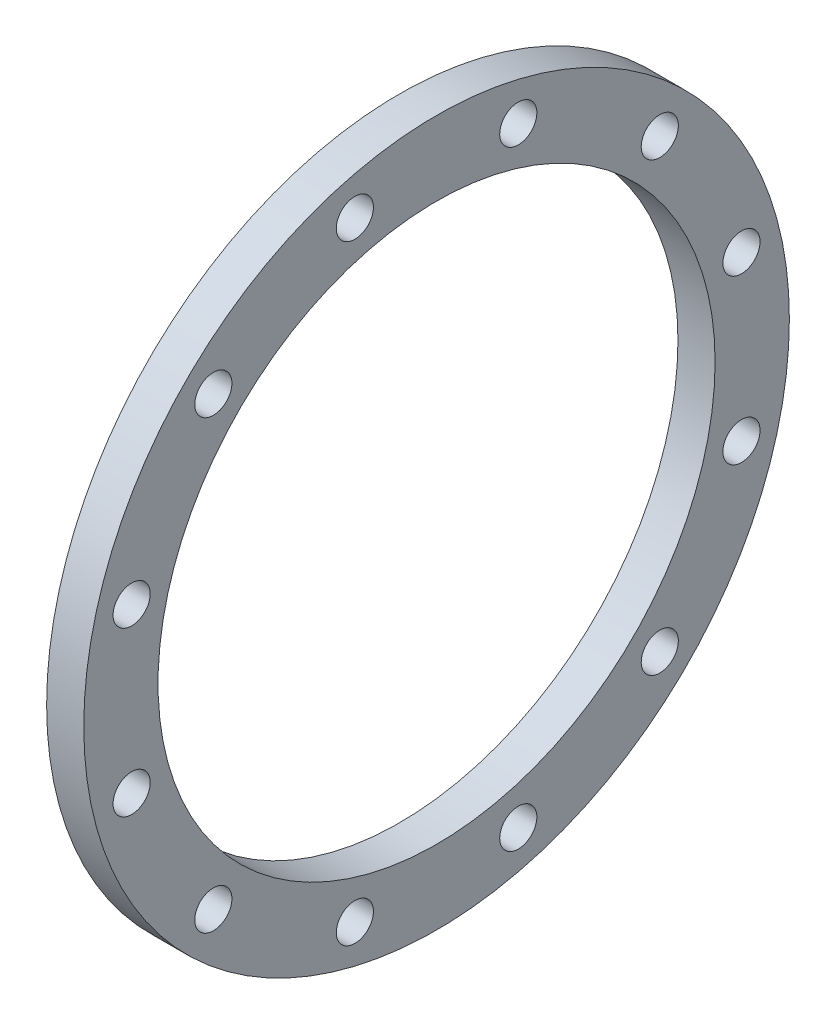
ISO-10303-21;
HEADER;
FILE_DESCRIPTION(('STEP AP214'),'2;1');
FILE_NAME('part.step','',(''),(''),'','','');
FILE_SCHEMA(('AUTOMOTIVE_DESIGN { 1 0 10303 214 1 1 1 1 }'));
ENDSEC;
DATA;
#1=APPLICATION_CONTEXT('core data for automotive mechanical design processes');
#2=APPLICATION_PROTOCOL_DEFINITION('international standard','automotive_design',2000,#1);
#3=PRODUCT_CONTEXT('',#1,'mechanical');
#4=PRODUCT('Part','Part','',(#3));
#5=PRODUCT_RELATED_PRODUCT_CATEGORY('part','',(#4));
#6=PRODUCT_DEFINITION_FORMATION('','',#4);
#7=PRODUCT_DEFINITION_CONTEXT('part definition',#1,'design');
#8=PRODUCT_DEFINITION('design','',#6,#7);
#9=PRODUCT_DEFINITION_SHAPE('','',#8);
#10=(LENGTH_UNIT() NAMED_UNIT(*) SI_UNIT(.MILLI.,.METRE.));
#11=(NAMED_UNIT(*) PLANE_ANGLE_UNIT() SI_UNIT($,.RADIAN.));
#12=(NAMED_UNIT(*) SI_UNIT($,.STERADIAN.) SOLID_ANGLE_UNIT());
#13=UNCERTAINTY_MEASURE_WITH_UNIT(LENGTH_MEASURE(1.E-05),#10,'distance_accuracy_value','');
#14=(GEOMETRIC_REPRESENTATION_CONTEXT(3) GLOBAL_UNCERTAINTY_ASSIGNED_CONTEXT((#13)) GLOBAL_UNIT_ASSIGNED_CONTEXT((#10,
#11,#12)) REPRESENTATION_CONTEXT('',''));
#15=CARTESIAN_POINT('',(0.,0.,0.));
#16=DIRECTION('',(0.,0.,1.));
#17=DIRECTION('',(1.,0.,0.));
#18=AXIS2_PLACEMENT_3D('',#15,#16,#17);
#19=CARTESIAN_POINT('',(12.7,316.3,0.));
#20=DIRECTION('',(1.,0.,0.));
#21=DIRECTION('',(0.,0.,-1.));
#22=AXIS2_PLACEMENT_3D('',#19,#20,#21);
#23=PLANE('',#22);
#24=CARTESIAN_POINT('',(12.7,372.179031837631,-208.543385895811));
#25=DIRECTION('',(1.,0.,0.));
#26=DIRECTION('',(0.,0.499999999999989,-0.866025403784445));
#27=AXIS2_PLACEMENT_3D('',#24,#25,#26);
#28=CIRCLE('',#27,12.7);
#29=CARTESIAN_POINT('',(12.7,378.529031837631,-219.541908523873));
#30=VERTEX_POINT('',#29);
#31=EDGE_CURVE('E74',#30,#30,#28,.T.);
#32=ORIENTED_EDGE('',*,*,#31,.F.);
#33=EDGE_LOOP('',(#32));
#34=FACE_BOUND('',#33,.T.);
#35=CARTESIAN_POINT('',(12.7,468.964354058174,-152.664354058178));
#36=DIRECTION('',(1.,0.,0.));
#37=DIRECTION('',(0.,0.866025403784433,-0.50000000000001));
#38=AXIS2_PLACEMENT_3D('',#35,#36,#37);
#39=CIRCLE('',#38,12.7);
#40=CARTESIAN_POINT('',(12.7,479.962876686236,-159.014354058178));
#41=VERTEX_POINT('',#40);
#42=EDGE_CURVE('E81',#41,#41,#39,.T.);
#43=ORIENTED_EDGE('',*,*,#42,.F.);
#44=EDGE_LOOP('',(#43));
#45=FACE_BOUND('',#44,.T.);
#46=CARTESIAN_POINT('',(12.7,524.843385895809,-55.8790318376366));
#47=DIRECTION('',(1.,0.,0.));
#48=DIRECTION('',(0.,1.,0.));
#49=AXIS2_PLACEMENT_3D('',#46,#47,#48);
#50=CIRCLE('',#49,12.7);
#51=CARTESIAN_POINT('',(12.7,537.543385895809,-55.8790318376367));
#52=VERTEX_POINT('',#51);
#53=EDGE_CURVE('E87',#52,#52,#50,.T.);
#54=ORIENTED_EDGE('',*,*,#53,.F.);
#55=EDGE_LOOP('',(#54));
#56=FACE_BOUND('',#55,.T.);
#57=CARTESIAN_POINT('',(12.7,524.84338589581,55.8790318376321));
#58=DIRECTION('',(1.,0.,0.));
#59=DIRECTION('',(0.,0.866025403784443,0.499999999999992));
#60=AXIS2_PLACEMENT_3D('',#57,#58,#59);
#61=CIRCLE('',#60,12.7);
#62=CARTESIAN_POINT('',(12.7,535.841908523873,62.229031837632));
#63=VERTEX_POINT('',#62);
#64=EDGE_CURVE('E93',#63,#63,#61,.T.);
#65=ORIENTED_EDGE('',*,*,#64,.F.);
#66=EDGE_LOOP('',(#65));
#67=FACE_BOUND('',#66,.T.);
#68=CARTESIAN_POINT('',(12.7,468.964354058177,152.664354058174));
#69=DIRECTION('',(1.,0.,0.));
#70=DIRECTION('',(0.,0.500000000000007,0.866025403784435));
#71=AXIS2_PLACEMENT_3D('',#68,#69,#70);
#72=CIRCLE('',#71,12.7);
#73=CARTESIAN_POINT('',(12.7,475.314354058177,163.662876686237));
#74=VERTEX_POINT('',#73);
#75=EDGE_CURVE('E99',#74,#74,#72,.T.);
#76=ORIENTED_EDGE('',*,*,#75,.F.);
#77=EDGE_LOOP('',(#76));
#78=FACE_BOUND('',#77,.T.);
#79=CARTESIAN_POINT('',(12.7,372.179031837634,208.54338589581));
#80=DIRECTION('',(1.,0.,0.));
#81=DIRECTION('',(0.,0.,1.));
#82=AXIS2_PLACEMENT_3D('',#79,#80,#81);
#83=CIRCLE('',#82,12.7);
#84=CARTESIAN_POINT('',(12.7,372.179031837634,221.24338589581));
#85=VERTEX_POINT('',#84);
#86=EDGE_CURVE('E105',#85,#85,#83,.T.);
#87=ORIENTED_EDGE('',*,*,#86,.F.);
#88=EDGE_LOOP('',(#87));
#89=FACE_BOUND('',#88,.T.);
#90=CARTESIAN_POINT('',(12.7,260.420968162367,208.54338589581));
#91=DIRECTION('',(1.,0.,0.));
#92=DIRECTION('',(0.,-0.499999999999995,0.866025403784442));
#93=AXIS2_PLACEMENT_3D('',#90,#91,#92);
#94=CIRCLE('',#93,12.7);
#95=CARTESIAN_POINT('',(12.7,254.070968162367,219.541908523873));
#96=VERTEX_POINT('',#95);
#97=EDGE_CURVE('E111',#96,#96,#94,.T.);
#98=ORIENTED_EDGE('',*,*,#97,.F.);
#99=EDGE_LOOP('',(#98));
#100=FACE_BOUND('',#99,.T.);
#101=CARTESIAN_POINT('',(12.7,163.635645941825,152.664354058176));
#102=DIRECTION('',(1.,0.,0.));
#103=DIRECTION('',(0.,-0.866025403784436,0.500000000000004));
#104=AXIS2_PLACEMENT_3D('',#101,#102,#103);
#105=CIRCLE('',#104,12.7);
#106=CARTESIAN_POINT('',(12.7,152.637123313763,159.014354058177));
#107=VERTEX_POINT('',#106);
#108=EDGE_CURVE('E117',#107,#107,#105,.T.);
#109=ORIENTED_EDGE('',*,*,#108,.F.);
#110=EDGE_LOOP('',(#109));
#111=FACE_BOUND('',#110,.T.);
#112=CARTESIAN_POINT('',(12.7,107.75661410419,55.8790318376352));
#113=DIRECTION('',(1.,0.,0.));
#114=DIRECTION('',(0.,-1.,0.));
#115=AXIS2_PLACEMENT_3D('',#112,#113,#114);
#116=CIRCLE('',#115,12.7);
#117=CARTESIAN_POINT('',(12.7,95.0566141041904,55.8790318376352));
#118=VERTEX_POINT('',#117);
#119=EDGE_CURVE('E123',#118,#118,#116,.T.);
#120=ORIENTED_EDGE('',*,*,#119,.F.);
#121=EDGE_LOOP('',(#120));
#122=FACE_BOUND('',#121,.T.);
#123=CARTESIAN_POINT('',(12.7,107.75661410419,-55.8790318376335));
#124=DIRECTION('',(1.,0.,0.));
#125=DIRECTION('',(0.,-0.86602540378444,-0.499999999999998));
#126=AXIS2_PLACEMENT_3D('',#123,#124,#125);
#127=CIRCLE('',#126,12.7);
#128=CARTESIAN_POINT('',(12.7,96.7580914761276,-62.2290318376335));
#129=VERTEX_POINT('',#128);
#130=EDGE_CURVE('E73',#129,#129,#127,.T.);
#131=ORIENTED_EDGE('',*,*,#130,.F.);
#132=EDGE_LOOP('',(#131));
#133=FACE_BOUND('',#132,.T.);
#134=CARTESIAN_POINT('',(12.7,163.635645941824,-152.664354058175));
#135=DIRECTION('',(1.,0.,0.));
#136=DIRECTION('',(0.,-0.500000000000001,-0.866025403784438));
#137=AXIS2_PLACEMENT_3D('',#134,#135,#136);
#138=CIRCLE('',#137,12.7);
#139=CARTESIAN_POINT('',(12.7,157.285645941824,-163.662876686238));
#140=VERTEX_POINT('',#139);
#141=EDGE_CURVE('E67',#140,#140,#138,.T.);
#142=ORIENTED_EDGE('',*,*,#141,.F.);
#143=EDGE_LOOP('',(#142));
#144=FACE_BOUND('',#143,.T.);
#145=CARTESIAN_POINT('',(12.7,260.420968162366,-208.54338589581));
#146=DIRECTION('',(1.,0.,0.));
#147=DIRECTION('',(0.,0.,-1.));
#148=AXIS2_PLACEMENT_3D('',#145,#146,#147);
#149=CIRCLE('',#148,12.7);
#150=CARTESIAN_POINT('',(12.7,260.420968162366,-221.24338589581));
#151=VERTEX_POINT('',#150);
#152=EDGE_CURVE('E64',#151,#151,#149,.T.);
#153=ORIENTED_EDGE('',*,*,#152,.F.);
#154=EDGE_LOOP('',(#153));
#155=FACE_BOUND('',#154,.T.);
#156=CARTESIAN_POINT('',(12.7,316.3,0.));
#157=DIRECTION('',(1.,0.,0.));
#158=DIRECTION('',(0.,0.,-1.));
#159=AXIS2_PLACEMENT_3D('',#156,#157,#158);
#160=CIRCLE('',#159,241.3);
#161=CARTESIAN_POINT('',(12.7,316.3,-241.3));
#162=VERTEX_POINT('',#161);
#163=EDGE_CURVE('E11',#162,#162,#160,.T.);
#164=ORIENTED_EDGE('',*,*,#163,.T.);
#165=EDGE_LOOP('',(#164));
#166=FACE_BOUND('',#165,.T.);
#167=CARTESIAN_POINT('',(12.7,316.3,0.));
#168=DIRECTION('',(1.,0.,0.));
#169=DIRECTION('',(0.,0.,-1.));
#170=AXIS2_PLACEMENT_3D('',#167,#168,#169);
#171=CIRCLE('',#170,190.5);
#172=CARTESIAN_POINT('',(12.7,316.3,-190.5));
#173=VERTEX_POINT('',#172);
#174=EDGE_CURVE('E54',#173,#173,#171,.T.);
#175=ORIENTED_EDGE('',*,*,#174,.F.);
#176=EDGE_LOOP('',(#175));
#177=FACE_BOUND('',#176,.T.);
#178=ADVANCED_FACE('F43',(#34,#45,#56,#67,#78,#89,#100,#111,#122,#133,#144,#155,#166,#177),#23,.T.);
#179=CARTESIAN_POINT('',(-12.7,316.3,0.));
#180=DIRECTION('',(1.,0.,0.));
#181=DIRECTION('',(0.,0.,-1.));
#182=AXIS2_PLACEMENT_3D('',#179,#180,#181);
#183=PLANE('',#182);
#184=CARTESIAN_POINT('',(-12.7,372.179031837631,-208.543385895811));
#185=DIRECTION('',(1.,0.,0.));
#186=DIRECTION('',(0.,0.499999999999989,-0.866025403784445));
#187=AXIS2_PLACEMENT_3D('',#184,#185,#186);
#188=CIRCLE('',#187,12.7);
#189=CARTESIAN_POINT('',(-12.7,378.529031837631,-219.541908523873));
#190=VERTEX_POINT('',#189);
#191=EDGE_CURVE('E78',#190,#190,#188,.T.);
#192=ORIENTED_EDGE('',*,*,#191,.T.);
#193=EDGE_LOOP('',(#192));
#194=FACE_BOUND('',#193,.T.);
#195=CARTESIAN_POINT('',(-12.7,468.964354058174,-152.664354058178));
#196=DIRECTION('',(1.,0.,0.));
#197=DIRECTION('',(0.,0.866025403784433,-0.50000000000001));
#198=AXIS2_PLACEMENT_3D('',#195,#196,#197);
#199=CIRCLE('',#198,12.7);
#200=CARTESIAN_POINT('',(-12.7,479.962876686236,-159.014354058178));
#201=VERTEX_POINT('',#200);
#202=EDGE_CURVE('E77',#201,#201,#199,.T.);
#203=ORIENTED_EDGE('',*,*,#202,.T.);
#204=EDGE_LOOP('',(#203));
#205=FACE_BOUND('',#204,.T.);
#206=CARTESIAN_POINT('',(-12.7,524.843385895809,-55.8790318376366));
#207=DIRECTION('',(1.,0.,0.));
#208=DIRECTION('',(0.,1.,0.));
#209=AXIS2_PLACEMENT_3D('',#206,#207,#208);
#210=CIRCLE('',#209,12.7);
#211=CARTESIAN_POINT('',(-12.7,537.543385895809,-55.8790318376367));
#212=VERTEX_POINT('',#211);
#213=EDGE_CURVE('E84',#212,#212,#210,.T.);
#214=ORIENTED_EDGE('',*,*,#213,.T.);
#215=EDGE_LOOP('',(#214));
#216=FACE_BOUND('',#215,.T.);
#217=CARTESIAN_POINT('',(-12.7,524.84338589581,55.8790318376321));
#218=DIRECTION('',(1.,0.,0.));
#219=DIRECTION('',(0.,0.866025403784443,0.499999999999992));
#220=AXIS2_PLACEMENT_3D('',#217,#218,#219);
#221=CIRCLE('',#220,12.7);
#222=CARTESIAN_POINT('',(-12.7,535.841908523873,62.229031837632));
#223=VERTEX_POINT('',#222);
#224=EDGE_CURVE('E90',#223,#223,#221,.T.);
#225=ORIENTED_EDGE('',*,*,#224,.T.);
#226=EDGE_LOOP('',(#225));
#227=FACE_BOUND('',#226,.T.);
#228=CARTESIAN_POINT('',(-12.7,468.964354058177,152.664354058174));
#229=DIRECTION('',(1.,0.,0.));
#230=DIRECTION('',(0.,0.500000000000007,0.866025403784435));
#231=AXIS2_PLACEMENT_3D('',#228,#229,#230);
#232=CIRCLE('',#231,12.7);
#233=CARTESIAN_POINT('',(-12.7,475.314354058177,163.662876686237));
#234=VERTEX_POINT('',#233);
#235=EDGE_CURVE('E96',#234,#234,#232,.T.);
#236=ORIENTED_EDGE('',*,*,#235,.T.);
#237=EDGE_LOOP('',(#236));
#238=FACE_BOUND('',#237,.T.);
#239=CARTESIAN_POINT('',(-12.7,372.179031837634,208.54338589581));
#240=DIRECTION('',(1.,0.,0.));
#241=DIRECTION('',(0.,0.,1.));
#242=AXIS2_PLACEMENT_3D('',#239,#240,#241);
#243=CIRCLE('',#242,12.7);
#244=CARTESIAN_POINT('',(-12.7,372.179031837634,221.24338589581));
#245=VERTEX_POINT('',#244);
#246=EDGE_CURVE('E102',#245,#245,#243,.T.);
#247=ORIENTED_EDGE('',*,*,#246,.T.);
#248=EDGE_LOOP('',(#247));
#249=FACE_BOUND('',#248,.T.);
#250=CARTESIAN_POINT('',(-12.7,260.420968162367,208.54338589581));
#251=DIRECTION('',(1.,0.,0.));
#252=DIRECTION('',(0.,-0.499999999999995,0.866025403784442));
#253=AXIS2_PLACEMENT_3D('',#250,#251,#252);
#254=CIRCLE('',#253,12.7);
#255=CARTESIAN_POINT('',(-12.7,254.070968162367,219.541908523873));
#256=VERTEX_POINT('',#255);
#257=EDGE_CURVE('E108',#256,#256,#254,.T.);
#258=ORIENTED_EDGE('',*,*,#257,.T.);
#259=EDGE_LOOP('',(#258));
#260=FACE_BOUND('',#259,.T.);
#261=CARTESIAN_POINT('',(-12.7,163.635645941825,152.664354058176));
#262=DIRECTION('',(1.,0.,0.));
#263=DIRECTION('',(0.,-0.866025403784436,0.500000000000004));
#264=AXIS2_PLACEMENT_3D('',#261,#262,#263);
#265=CIRCLE('',#264,12.7);
#266=CARTESIAN_POINT('',(-12.7,152.637123313763,159.014354058177));
#267=VERTEX_POINT('',#266);
#268=EDGE_CURVE('E114',#267,#267,#265,.T.);
#269=ORIENTED_EDGE('',*,*,#268,.T.);
#270=EDGE_LOOP('',(#269));
#271=FACE_BOUND('',#270,.T.);
#272=CARTESIAN_POINT('',(-12.7,107.75661410419,55.8790318376352));
#273=DIRECTION('',(1.,0.,0.));
#274=DIRECTION('',(0.,-1.,0.));
#275=AXIS2_PLACEMENT_3D('',#272,#273,#274);
#276=CIRCLE('',#275,12.7);
#277=CARTESIAN_POINT('',(-12.7,95.0566141041904,55.8790318376352));
#278=VERTEX_POINT('',#277);
#279=EDGE_CURVE('E120',#278,#278,#276,.T.);
#280=ORIENTED_EDGE('',*,*,#279,.T.);
#281=EDGE_LOOP('',(#280));
#282=FACE_BOUND('',#281,.T.);
#283=CARTESIAN_POINT('',(-12.7,107.75661410419,-55.8790318376335));
#284=DIRECTION('',(1.,0.,0.));
#285=DIRECTION('',(0.,-0.86602540378444,-0.499999999999998));
#286=AXIS2_PLACEMENT_3D('',#283,#284,#285);
#287=CIRCLE('',#286,12.7);
#288=CARTESIAN_POINT('',(-12.7,96.7580914761276,-62.2290318376335));
#289=VERTEX_POINT('',#288);
#290=EDGE_CURVE('E126',#289,#289,#287,.T.);
#291=ORIENTED_EDGE('',*,*,#290,.T.);
#292=EDGE_LOOP('',(#291));
#293=FACE_BOUND('',#292,.T.);
#294=CARTESIAN_POINT('',(-12.7,163.635645941824,-152.664354058175));
#295=DIRECTION('',(1.,0.,0.));
#296=DIRECTION('',(0.,-0.500000000000001,-0.866025403784438));
#297=AXIS2_PLACEMENT_3D('',#294,#295,#296);
#298=CIRCLE('',#297,12.7);
#299=CARTESIAN_POINT('',(-12.7,157.285645941824,-163.662876686238));
#300=VERTEX_POINT('',#299);
#301=EDGE_CURVE('E70',#300,#300,#298,.T.);
#302=ORIENTED_EDGE('',*,*,#301,.T.);
#303=EDGE_LOOP('',(#302));
#304=FACE_BOUND('',#303,.T.);
#305=CARTESIAN_POINT('',(-12.7,260.420968162366,-208.54338589581));
#306=DIRECTION('',(1.,0.,0.));
#307=DIRECTION('',(0.,0.,-1.));
#308=AXIS2_PLACEMENT_3D('',#305,#306,#307);
#309=CIRCLE('',#308,12.7);
#310=CARTESIAN_POINT('',(-12.7,260.420968162366,-221.24338589581));
#311=VERTEX_POINT('',#310);
#312=EDGE_CURVE('E59',#311,#311,#309,.T.);
#313=ORIENTED_EDGE('',*,*,#312,.T.);
#314=EDGE_LOOP('',(#313));
#315=FACE_BOUND('',#314,.T.);
#316=CARTESIAN_POINT('',(-12.7,316.3,0.));
#317=DIRECTION('',(1.,0.,0.));
#318=DIRECTION('',(0.,0.,-1.));
#319=AXIS2_PLACEMENT_3D('',#316,#317,#318);
#320=CIRCLE('',#319,241.3);
#321=CARTESIAN_POINT('',(-12.7,316.3,-241.3));
#322=VERTEX_POINT('',#321);
#323=EDGE_CURVE('E47',#322,#322,#320,.T.);
#324=ORIENTED_EDGE('',*,*,#323,.F.);
#325=EDGE_LOOP('',(#324));
#326=FACE_BOUND('',#325,.T.);
#327=CARTESIAN_POINT('',(-12.7,316.3,0.));
#328=DIRECTION('',(1.,0.,0.));
#329=DIRECTION('',(0.,0.,-1.));
#330=AXIS2_PLACEMENT_3D('',#327,#328,#329);
#331=CIRCLE('',#330,190.5);
#332=CARTESIAN_POINT('',(-12.7,316.3,-190.5));
#333=VERTEX_POINT('',#332);
#334=EDGE_CURVE('E56',#333,#333,#331,.T.);
#335=ORIENTED_EDGE('',*,*,#334,.T.);
#336=EDGE_LOOP('',(#335));
#337=FACE_BOUND('',#336,.T.);
#338=ADVANCED_FACE('F134',(#194,#205,#216,#227,#238,#249,#260,#271,#282,#293,#304,#315,#326,
#337),#183,.F.);
#339=CARTESIAN_POINT('',(12.7,316.3,0.));
#340=DIRECTION('',(-1.,0.,0.));
#341=DIRECTION('',(0.,0.,1.));
#342=AXIS2_PLACEMENT_3D('',#339,#340,#341);
#343=CYLINDRICAL_SURFACE('',#342,241.3);
#344=ORIENTED_EDGE('',*,*,#163,.F.);
#345=EDGE_LOOP('',(#344));
#346=FACE_BOUND('',#345,.T.);
#347=ORIENTED_EDGE('',*,*,#323,.T.);
#348=EDGE_LOOP('',(#347));
#349=FACE_BOUND('',#348,.T.);
#350=ADVANCED_FACE('F45',(#346,#349),#343,.T.);
#351=CARTESIAN_POINT('',(12.7,316.3,0.));
#352=DIRECTION('',(-1.,0.,0.));
#353=DIRECTION('',(0.,0.,1.));
#354=AXIS2_PLACEMENT_3D('',#351,#352,#353);
#355=CYLINDRICAL_SURFACE('',#354,190.5);
#356=ORIENTED_EDGE('',*,*,#174,.T.);
#357=EDGE_LOOP('',(#356));
#358=FACE_BOUND('',#357,.T.);
#359=ORIENTED_EDGE('',*,*,#334,.F.);
#360=EDGE_LOOP('',(#359));
#361=FACE_BOUND('',#360,.T.);
#362=ADVANCED_FACE('F155',(#358,#361),#355,.F.);
#363=CARTESIAN_POINT('',(12.7,260.420968162366,-208.54338589581));
#364=DIRECTION('',(1.,0.,0.));
#365=DIRECTION('',(0.,0.,-1.));
#366=AXIS2_PLACEMENT_3D('',#363,#364,#365);
#367=CYLINDRICAL_SURFACE('',#366,12.7);
#368=ORIENTED_EDGE('',*,*,#312,.F.);
#369=EDGE_LOOP('',(#368));
#370=FACE_BOUND('',#369,.T.);
#371=ORIENTED_EDGE('',*,*,#152,.T.);
#372=EDGE_LOOP('',(#371));
#373=FACE_BOUND('',#372,.T.);
#374=ADVANCED_FACE('F158',(#370,#373),#367,.F.);
#375=CARTESIAN_POINT('',(12.7,163.635645941824,-152.664354058175));
#376=DIRECTION('',(1.,0.,0.));
#377=DIRECTION('',(0.,-0.500000000000001,-0.866025403784438));
#378=AXIS2_PLACEMENT_3D('',#375,#376,#377);
#379=CYLINDRICAL_SURFACE('',#378,12.7);
#380=ORIENTED_EDGE('',*,*,#301,.F.);
#381=EDGE_LOOP('',(#380));
#382=FACE_BOUND('',#381,.T.);
#383=ORIENTED_EDGE('',*,*,#141,.T.);
#384=EDGE_LOOP('',(#383));
#385=FACE_BOUND('',#384,.T.);
#386=ADVANCED_FACE('F141',(#382,#385),#379,.F.);
#387=CARTESIAN_POINT('',(12.7,107.75661410419,-55.8790318376335));
#388=DIRECTION('',(1.,0.,0.));
#389=DIRECTION('',(0.,-0.86602540378444,-0.499999999999998));
#390=AXIS2_PLACEMENT_3D('',#387,#388,#389);
#391=CYLINDRICAL_SURFACE('',#390,12.7);
#392=ORIENTED_EDGE('',*,*,#290,.F.);
#393=EDGE_LOOP('',(#392));
#394=FACE_BOUND('',#393,.T.);
#395=ORIENTED_EDGE('',*,*,#130,.T.);
#396=EDGE_LOOP('',(#395));
#397=FACE_BOUND('',#396,.T.);
#398=ADVANCED_FACE('F137',(#394,#397),#391,.F.);
#399=CARTESIAN_POINT('',(12.7,107.75661410419,55.8790318376352));
#400=DIRECTION('',(1.,0.,0.));
#401=DIRECTION('',(0.,-1.,0.));
#402=AXIS2_PLACEMENT_3D('',#399,#400,#401);
#403=CYLINDRICAL_SURFACE('',#402,12.7);
#404=ORIENTED_EDGE('',*,*,#279,.F.);
#405=EDGE_LOOP('',(#404));
#406=FACE_BOUND('',#405,.T.);
#407=ORIENTED_EDGE('',*,*,#119,.T.);
#408=EDGE_LOOP('',(#407));
#409=FACE_BOUND('',#408,.T.);
#410=ADVANCED_FACE('F140',(#406,#409),#403,.F.);
#411=CARTESIAN_POINT('',(12.7,163.635645941825,152.664354058176));
#412=DIRECTION('',(1.,0.,0.));
#413=DIRECTION('',(0.,-0.866025403784436,0.500000000000004));
#414=AXIS2_PLACEMENT_3D('',#411,#412,#413);
#415=CYLINDRICAL_SURFACE('',#414,12.7);
#416=ORIENTED_EDGE('',*,*,#268,.F.);
#417=EDGE_LOOP('',(#416));
#418=FACE_BOUND('',#417,.T.);
#419=ORIENTED_EDGE('',*,*,#108,.T.);
#420=EDGE_LOOP('',(#419));
#421=FACE_BOUND('',#420,.T.);
#422=ADVANCED_FACE('F203',(#418,#421),#415,.F.);
#423=CARTESIAN_POINT('',(12.7,260.420968162367,208.54338589581));
#424=DIRECTION('',(1.,0.,0.));
#425=DIRECTION('',(0.,-0.499999999999995,0.866025403784442));
#426=AXIS2_PLACEMENT_3D('',#423,#424,#425);
#427=CYLINDRICAL_SURFACE('',#426,12.7);
#428=ORIENTED_EDGE('',*,*,#257,.F.);
#429=EDGE_LOOP('',(#428));
#430=FACE_BOUND('',#429,.T.);
#431=ORIENTED_EDGE('',*,*,#97,.T.);
#432=EDGE_LOOP('',(#431));
#433=FACE_BOUND('',#432,.T.);
#434=ADVANCED_FACE('F199',(#430,#433),#427,.F.);
#435=CARTESIAN_POINT('',(12.7,372.179031837634,208.54338589581));
#436=DIRECTION('',(1.,0.,0.));
#437=DIRECTION('',(0.,0.,1.));
#438=AXIS2_PLACEMENT_3D('',#435,#436,#437);
#439=CYLINDRICAL_SURFACE('',#438,12.7);
#440=ORIENTED_EDGE('',*,*,#246,.F.);
#441=EDGE_LOOP('',(#440));
#442=FACE_BOUND('',#441,.T.);
#443=ORIENTED_EDGE('',*,*,#86,.T.);
#444=EDGE_LOOP('',(#443));
#445=FACE_BOUND('',#444,.T.);
#446=ADVANCED_FACE('F195',(#442,#445),#439,.F.);
#447=CARTESIAN_POINT('',(12.7,468.964354058177,152.664354058174));
#448=DIRECTION('',(1.,0.,0.));
#449=DIRECTION('',(0.,0.500000000000007,0.866025403784435));
#450=AXIS2_PLACEMENT_3D('',#447,#448,#449);
#451=CYLINDRICAL_SURFACE('',#450,12.7);
#452=ORIENTED_EDGE('',*,*,#235,.F.);
#453=EDGE_LOOP('',(#452));
#454=FACE_BOUND('',#453,.T.);
#455=ORIENTED_EDGE('',*,*,#75,.T.);
#456=EDGE_LOOP('',(#455));
#457=FACE_BOUND('',#456,.T.);
#458=ADVANCED_FACE('F191',(#454,#457),#451,.F.);
#459=CARTESIAN_POINT('',(12.7,524.84338589581,55.8790318376321));
#460=DIRECTION('',(1.,0.,0.));
#461=DIRECTION('',(0.,0.866025403784443,0.499999999999992));
#462=AXIS2_PLACEMENT_3D('',#459,#460,#461);
#463=CYLINDRICAL_SURFACE('',#462,12.7);
#464=ORIENTED_EDGE('',*,*,#224,.F.);
#465=EDGE_LOOP('',(#464));
#466=FACE_BOUND('',#465,.T.);
#467=ORIENTED_EDGE('',*,*,#64,.T.);
#468=EDGE_LOOP('',(#467));
#469=FACE_BOUND('',#468,.T.);
#470=ADVANCED_FACE('F187',(#466,#469),#463,.F.);
#471=CARTESIAN_POINT('',(12.7,524.843385895809,-55.8790318376366));
#472=DIRECTION('',(1.,0.,0.));
#473=DIRECTION('',(0.,1.,0.));
#474=AXIS2_PLACEMENT_3D('',#471,#472,#473);
#475=CYLINDRICAL_SURFACE('',#474,12.7);
#476=ORIENTED_EDGE('',*,*,#213,.F.);
#477=EDGE_LOOP('',(#476));
#478=FACE_BOUND('',#477,.T.);
#479=ORIENTED_EDGE('',*,*,#53,.T.);
#480=EDGE_LOOP('',(#479));
#481=FACE_BOUND('',#480,.T.);
#482=ADVANCED_FACE('F183',(#478,#481),#475,.F.);
#483=CARTESIAN_POINT('',(12.7,468.964354058174,-152.664354058178));
#484=DIRECTION('',(1.,0.,0.));
#485=DIRECTION('',(0.,0.866025403784433,-0.50000000000001));
#486=AXIS2_PLACEMENT_3D('',#483,#484,#485);
#487=CYLINDRICAL_SURFACE('',#486,12.7);
#488=ORIENTED_EDGE('',*,*,#202,.F.);
#489=EDGE_LOOP('',(#488));
#490=FACE_BOUND('',#489,.T.);
#491=ORIENTED_EDGE('',*,*,#42,.T.);
#492=EDGE_LOOP('',(#491));
#493=FACE_BOUND('',#492,.T.);
#494=ADVANCED_FACE('F179',(#490,#493),#487,.F.);
#495=CARTESIAN_POINT('',(12.7,372.179031837631,-208.543385895811));
#496=DIRECTION('',(1.,0.,0.));
#497=DIRECTION('',(0.,0.499999999999989,-0.866025403784445));
#498=AXIS2_PLACEMENT_3D('',#495,#496,#497);
#499=CYLINDRICAL_SURFACE('',#498,12.7);
#500=ORIENTED_EDGE('',*,*,#191,.F.);
#501=EDGE_LOOP('',(#500));
#502=FACE_BOUND('',#501,.T.);
#503=ORIENTED_EDGE('',*,*,#31,.T.);
#504=EDGE_LOOP('',(#503));
#505=FACE_BOUND('',#504,.T.);
#506=ADVANCED_FACE('F176',(#502,#505),#499,.F.);
#507=CLOSED_SHELL('',(#178,#338,#350,#362,#374,#386,#398,#410,#422,#434,#446,#458,#470,#482,
#494,#506));
#508=MANIFOLD_SOLID_BREP('B2',#507);
#509=ADVANCED_BREP_SHAPE_REPRESENTATION('',(#18,#508),#14);
#510=SHAPE_DEFINITION_REPRESENTATION(#9,#509);
ENDSEC;
END-ISO-10303-21;
